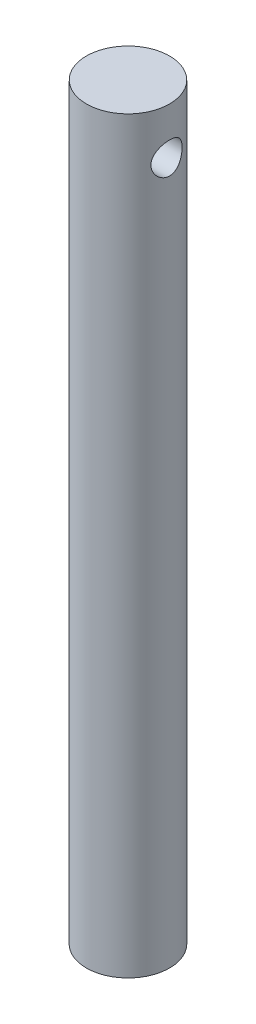
ISO-10303-21;
HEADER;
FILE_DESCRIPTION(('STEP AP214'),'2;1');
FILE_NAME('part.step','',(''),(''),'','','');
FILE_SCHEMA(('AUTOMOTIVE_DESIGN { 1 0 10303 214 1 1 1 1 }'));
ENDSEC;
DATA;
#1=APPLICATION_CONTEXT('core data for automotive mechanical design processes');
#2=APPLICATION_PROTOCOL_DEFINITION('international standard','automotive_design',2000,#1);
#3=PRODUCT_CONTEXT('',#1,'mechanical');
#4=PRODUCT('Part','Part','',(#3));
#5=PRODUCT_RELATED_PRODUCT_CATEGORY('part','',(#4));
#6=PRODUCT_DEFINITION_FORMATION('','',#4);
#7=PRODUCT_DEFINITION_CONTEXT('part definition',#1,'design');
#8=PRODUCT_DEFINITION('design','',#6,#7);
#9=PRODUCT_DEFINITION_SHAPE('','',#8);
#10=(LENGTH_UNIT() NAMED_UNIT(*) SI_UNIT(.MILLI.,.METRE.));
#11=(NAMED_UNIT(*) PLANE_ANGLE_UNIT() SI_UNIT($,.RADIAN.));
#12=(NAMED_UNIT(*) SI_UNIT($,.STERADIAN.) SOLID_ANGLE_UNIT());
#13=UNCERTAINTY_MEASURE_WITH_UNIT(LENGTH_MEASURE(1.E-05),#10,'distance_accuracy_value','');
#14=(GEOMETRIC_REPRESENTATION_CONTEXT(3) GLOBAL_UNCERTAINTY_ASSIGNED_CONTEXT((#13)) GLOBAL_UNIT_ASSIGNED_CONTEXT((#10,
#11,#12)) REPRESENTATION_CONTEXT('',''));
#15=CARTESIAN_POINT('',(0.,0.,0.));
#16=DIRECTION('',(0.,0.,1.));
#17=DIRECTION('',(1.,0.,0.));
#18=AXIS2_PLACEMENT_3D('',#15,#16,#17);
#19=CARTESIAN_POINT('',(0.,36.,0.));
#20=DIRECTION('',(0.,-1.,0.));
#21=DIRECTION('',(0.,0.,-1.));
#22=AXIS2_PLACEMENT_3D('',#19,#20,#21);
#23=CYLINDRICAL_SURFACE('',#22,2.);
#24=CARTESIAN_POINT('',(-1.85404962177392,33.75,-0.75));
#25=CARTESIAN_POINT('',(-1.85404820316903,33.7905037418604,-0.750001520530546));
#26=CARTESIAN_POINT('',(-1.85539130120493,33.8309974612518,-0.746707987747436));
#27=CARTESIAN_POINT('',(-1.86058079652483,33.9107640414566,-0.73368093947734));
#28=CARTESIAN_POINT('',(-1.86442711883556,33.9500369387975,-0.723947616866317));
#29=CARTESIAN_POINT('',(-1.8741274014045,34.0261876858068,-0.69844828805287));
#30=CARTESIAN_POINT('',(-1.8799765478463,34.0630710283255,-0.682696736331744));
#31=CARTESIAN_POINT('',(-1.89301567103299,34.1336859484094,-0.645659283713491));
#32=CARTESIAN_POINT('',(-1.90020605033661,34.1674165751413,-0.624371720475196));
#33=CARTESIAN_POINT('',(-1.91551787332856,34.2324451558114,-0.575733306870814));
#34=CARTESIAN_POINT('',(-1.92366670961802,34.2635642648147,-0.548151906066536));
#35=CARTESIAN_POINT('',(-1.93974875314273,34.3208614073357,-0.488197919889468));
#36=CARTESIAN_POINT('',(-1.94768191407392,34.3470383868709,-0.455824315128343));
#37=CARTESIAN_POINT('',(-1.96276436968277,34.3945697561478,-0.385847327588801));
#38=CARTESIAN_POINT('',(-1.96987780611753,34.4157297373579,-0.348103473769014));
#39=CARTESIAN_POINT('',(-1.98219003986924,34.4513255862625,-0.269277885982622));
#40=CARTESIAN_POINT('',(-1.98738950108503,34.465763785996,-0.228197315466766));
#41=CARTESIAN_POINT('',(-1.9950934855172,34.4868789478873,-0.145744670838414));
#42=CARTESIAN_POINT('',(-1.99770457607387,34.4938638137202,-0.104461598640797));
#43=CARTESIAN_POINT('',(-2.0003200705397,34.5008606004725,-0.021232181897393));
#44=CARTESIAN_POINT('',(-2.00032532207451,34.5008747888093,0.0207139425314158));
#45=CARTESIAN_POINT('',(-1.99779632951947,34.4941091192674,0.101871771532237));
#46=CARTESIAN_POINT('',(-1.99538770998342,34.4876653510256,0.141116089133449));
#47=CARTESIAN_POINT('',(-1.98846637466131,34.4687320423872,0.217919608992195));
#48=CARTESIAN_POINT('',(-1.98395350987789,34.456242073869,0.255478691715149));
#49=CARTESIAN_POINT('',(-1.97318884583765,34.4254147741621,0.328494508651552));
#50=CARTESIAN_POINT('',(-1.96691269735038,34.4069949973658,0.363912696143655));
#51=CARTESIAN_POINT('',(-1.9532565511264,34.3649039515353,0.43124330397878));
#52=CARTESIAN_POINT('',(-1.9458761975642,34.3412309884912,0.463154588466161));
#53=CARTESIAN_POINT('',(-1.93026264827908,34.2876863568584,0.524545243400468));
#54=CARTESIAN_POINT('',(-1.92200481881941,34.2575330421748,0.553773072631742));
#55=CARTESIAN_POINT('',(-1.90591230322861,34.1927035033392,0.606851977846713));
#56=CARTESIAN_POINT('',(-1.89807772374424,34.1580261467067,0.630701703464499));
#57=CARTESIAN_POINT('',(-1.88356351750168,34.0841402662686,0.672828059040756));
#58=CARTESIAN_POINT('',(-1.87691338575138,34.044848253157,0.690969239259152));
#59=CARTESIAN_POINT('',(-1.86586219314501,33.9634518874162,0.720282322207504));
#60=CARTESIAN_POINT('',(-1.86145988102892,33.9213491142032,0.731458103027974));
#61=CARTESIAN_POINT('',(-1.85569798611424,33.838012018842,0.745950958548341));
#62=CARTESIAN_POINT('',(-1.85418392620768,33.7968579472319,0.74966760579483));
#63=CARTESIAN_POINT('',(-1.85393269762508,33.7144953216291,0.750289428181361));
#64=CARTESIAN_POINT('',(-1.85519483501993,33.6732867838238,0.747196305468809));
#65=CARTESIAN_POINT('',(-1.86019690814868,33.5940350388562,0.734648667600784));
#66=CARTESIAN_POINT('',(-1.86381638108224,33.5559344321177,0.725503091671123));
#67=CARTESIAN_POINT('',(-1.87298243523181,33.4818260276399,0.701498873203189));
#68=CARTESIAN_POINT('',(-1.87852941125086,33.4458186604159,0.686639060173116));
#69=CARTESIAN_POINT('',(-1.8911812155804,33.3754177809619,0.651001461376389));
#70=CARTESIAN_POINT('',(-1.89833664446033,33.3411353539313,0.630022725885232));
#71=CARTESIAN_POINT('',(-1.91331407147146,33.276435509137,0.582956589312394));
#72=CARTESIAN_POINT('',(-1.92113631297038,33.2460195126877,0.556867318482174));
#73=CARTESIAN_POINT('',(-1.93716523276592,33.1879158134024,0.498363670450471));
#74=CARTESIAN_POINT('',(-1.94536484678514,33.1605232956156,0.465653170745531));
#75=CARTESIAN_POINT('',(-1.96074937481651,33.1115808162053,0.395898735876575));
#76=CARTESIAN_POINT('',(-1.96793428553832,33.0900308735271,0.358854786661336));
#77=CARTESIAN_POINT('',(-1.98047492852276,33.0535269719002,0.281508164734239));
#78=CARTESIAN_POINT('',(-1.98583690669005,33.0385504381037,0.241217216532314));
#79=CARTESIAN_POINT('',(-1.99414718356286,33.015671793075,0.158440943761628));
#80=CARTESIAN_POINT('',(-1.99709661649706,33.0077663572888,0.115956660361796));
#81=CARTESIAN_POINT('',(-2.00014203658537,32.9996127986226,0.0326677926369077));
#82=CARTESIAN_POINT('',(-2.00039430476882,32.9989452584705,-0.00809038403042248));
#83=CARTESIAN_POINT('',(-1.99842444904612,33.0042075797227,-0.0891133932062116));
#84=CARTESIAN_POINT('',(-1.99620262356565,33.0101366454429,-0.129378284622628));
#85=CARTESIAN_POINT('',(-1.98960544801886,33.0281294257468,-0.207274124188562));
#86=CARTESIAN_POINT('',(-1.98528395689009,33.0400399529392,-0.244945365534415));
#87=CARTESIAN_POINT('',(-1.97493891810495,33.0695050066922,-0.317757736503193));
#88=CARTESIAN_POINT('',(-1.96891504827832,33.0870606016524,-0.35289838563777));
#89=CARTESIAN_POINT('',(-1.95545309150037,33.1281569717524,-0.421270088497205));
#90=CARTESIAN_POINT('',(-1.94796620054414,33.1519183202571,-0.454358774423422));
#91=CARTESIAN_POINT('',(-1.93249753847422,33.2044039150938,-0.516208673761679));
#92=CARTESIAN_POINT('',(-1.92451559137014,33.2331299329039,-0.544968335627949));
#93=CARTESIAN_POINT('',(-1.90844064869588,33.2965320658225,-0.598906071180978));
#94=CARTESIAN_POINT('',(-1.9003640267458,33.3314422010772,-0.623814999080125));
#95=CARTESIAN_POINT('',(-1.88549162501819,33.4052079347867,-0.667423547784216));
#96=CARTESIAN_POINT('',(-1.87869597815608,33.4440639420267,-0.686122524390783));
#97=CARTESIAN_POINT('',(-1.86701134926633,33.5264778404877,-0.717329434871299));
#98=CARTESIAN_POINT('',(-1.8622190164543,33.5701671832559,-0.729530014497611));
#99=CARTESIAN_POINT('',(-1.85573997168158,33.6592426359779,-0.745861783610395));
#100=CARTESIAN_POINT('',(-1.85405121089868,33.704627606355,-0.749998296697853));
#101=CARTESIAN_POINT('',(-1.85404962177392,33.75,-0.75));
#102=B_SPLINE_CURVE_WITH_KNOTS('',3,(#24,#25,#26,#27,#28,#29,#30,#31,#32,#33,#34,#35,#36,#37,
#38,#39,#40,#41,#42,#43,#44,#45,#46,#47,#48,#49,#50,#51,#52,#53,#54,#55,#56,#57,#58,#59,#60,#61,
#62,#63,#64,#65,#66,#67,#68,#69,#70,#71,#72,#73,#74,#75,#76,#77,#78,#79,#80,#81,#82,#83,#84,#85,
#86,#87,#88,#89,#90,#91,#92,#93,#94,#95,#96,#97,#98,#99,#100,#101),.UNSPECIFIED.,.T.,.F.,(4,2,2,
2,2,2,2,2,2,2,2,2,2,2,2,2,2,2,2,2,2,2,2,2,2,2,2,2,2,2,2,2,2,2,2,2,2,2,4),(0.,0.121342270708086,
0.242680907299427,0.363729928378505,0.484815339841463,0.611373262005635,0.737958144114912,
0.868850360682108,0.999697131906655,1.1249000924484,1.25006232702429,1.36903236401597,
1.48801082631668,1.60872065605334,1.72946946814488,1.85728337532937,1.98512933913667,
2.11581296126482,2.24642375817737,2.36982828870243,2.49320197694442,2.610719229641,
2.72826056714763,2.85020780502911,2.97219974233178,3.10192508496812,3.23165084825089,
3.36092754445084,3.49014342780064,3.61182860274968,3.7334991015974,3.85220137001945,
3.97092611756416,4.09464161838494,4.21840135447483,4.3486929977104,4.47899815272121,
4.61501589435462,4.75094381161527),.UNSPECIFIED.);
#103=CARTESIAN_POINT('',(-1.85404962177392,33.75,-0.75));
#104=VERTEX_POINT('',#103);
#105=EDGE_CURVE('E41',#104,#104,#102,.T.);
#106=ORIENTED_EDGE('',*,*,#105,.T.);
#107=EDGE_LOOP('',(#106));
#108=FACE_BOUND('',#107,.T.);
#109=CARTESIAN_POINT('',(1.85404962177392,33.75,-0.75));
#110=CARTESIAN_POINT('',(1.85404820316903,33.7094962581396,-0.750001520530546));
#111=CARTESIAN_POINT('',(1.85539130120493,33.6690025387482,-0.746707987747436));
#112=CARTESIAN_POINT('',(1.86058079652483,33.5892359585434,-0.733680939477339));
#113=CARTESIAN_POINT('',(1.86442711883556,33.5499630612025,-0.723947616866317));
#114=CARTESIAN_POINT('',(1.8741274014045,33.4738123141932,-0.69844828805287));
#115=CARTESIAN_POINT('',(1.8799765478463,33.4369289716745,-0.682696736331742));
#116=CARTESIAN_POINT('',(1.89301567103299,33.3663140515906,-0.645659283713489));
#117=CARTESIAN_POINT('',(1.90020605033661,33.3325834248587,-0.624371720475195));
#118=CARTESIAN_POINT('',(1.91551787332856,33.2675548441886,-0.575733306870813));
#119=CARTESIAN_POINT('',(1.92366670961802,33.2364357351853,-0.548151906066536));
#120=CARTESIAN_POINT('',(1.93974875314273,33.1791385926642,-0.488197919889468));
#121=CARTESIAN_POINT('',(1.94768191407392,33.1529616131291,-0.455824315128343));
#122=CARTESIAN_POINT('',(1.96276436968277,33.1054302438522,-0.385847327588801));
#123=CARTESIAN_POINT('',(1.96987780611753,33.0842702626421,-0.348103473769014));
#124=CARTESIAN_POINT('',(1.98219003986924,33.0486744137375,-0.269277885982622));
#125=CARTESIAN_POINT('',(1.98738950108503,33.034236214004,-0.228197315466766));
#126=CARTESIAN_POINT('',(1.9950934855172,33.0131210521127,-0.145744670838414));
#127=CARTESIAN_POINT('',(1.99770457607387,33.0061361862798,-0.104461598640797));
#128=CARTESIAN_POINT('',(2.0003200705397,32.9991393995275,-0.021232181897393));
#129=CARTESIAN_POINT('',(2.00032532207451,32.9991252111906,0.0207139425314158));
#130=CARTESIAN_POINT('',(1.99779632951947,33.0058908807326,0.101871771532237));
#131=CARTESIAN_POINT('',(1.99538770998342,33.0123346489744,0.141116089133449));
#132=CARTESIAN_POINT('',(1.98846637466131,33.0312679576128,0.217919608992195));
#133=CARTESIAN_POINT('',(1.98395350987789,33.043757926131,0.255478691715149));
#134=CARTESIAN_POINT('',(1.97318884583765,33.0745852258379,0.328494508651552));
#135=CARTESIAN_POINT('',(1.96691269735038,33.0930050026342,0.363912696143655));
#136=CARTESIAN_POINT('',(1.9532565511264,33.1350960484647,0.43124330397878));
#137=CARTESIAN_POINT('',(1.9458761975642,33.1587690115088,0.463154588466161));
#138=CARTESIAN_POINT('',(1.93026264827908,33.2123136431416,0.524545243400468));
#139=CARTESIAN_POINT('',(1.92200481881941,33.2424669578252,0.553773072631742));
#140=CARTESIAN_POINT('',(1.90591230322861,33.3072964966608,0.606851977846713));
#141=CARTESIAN_POINT('',(1.89807772374424,33.3419738532933,0.630701703464499));
#142=CARTESIAN_POINT('',(1.88356351750168,33.4158597337314,0.672828059040756));
#143=CARTESIAN_POINT('',(1.87691338575138,33.455151746843,0.690969239259152));
#144=CARTESIAN_POINT('',(1.86586219314501,33.5365481125838,0.720282322207504));
#145=CARTESIAN_POINT('',(1.86145988102892,33.5786508857968,0.731458103027974));
#146=CARTESIAN_POINT('',(1.85569798611424,33.661987981158,0.745950958548341));
#147=CARTESIAN_POINT('',(1.85418392620768,33.7031420527681,0.74966760579483));
#148=CARTESIAN_POINT('',(1.85393269762508,33.7855046783709,0.750289428181361));
#149=CARTESIAN_POINT('',(1.85519483501993,33.8267132161762,0.747196305468809));
#150=CARTESIAN_POINT('',(1.86019690814868,33.9059649611438,0.734648667600784));
#151=CARTESIAN_POINT('',(1.86381638108224,33.9440655678823,0.725503091671123));
#152=CARTESIAN_POINT('',(1.87298243523181,34.0181739723601,0.701498873203189));
#153=CARTESIAN_POINT('',(1.87852941125086,34.0541813395841,0.686639060173116));
#154=CARTESIAN_POINT('',(1.8911812155804,34.1245822190381,0.651001461376389));
#155=CARTESIAN_POINT('',(1.89833664446033,34.1588646460687,0.630022725885232));
#156=CARTESIAN_POINT('',(1.91331407147146,34.223564490863,0.582956589312394));
#157=CARTESIAN_POINT('',(1.92113631297038,34.2539804873123,0.556867318482174));
#158=CARTESIAN_POINT('',(1.93716523276592,34.3120841865975,0.498363670450472));
#159=CARTESIAN_POINT('',(1.94536484678514,34.3394767043844,0.465653170745534));
#160=CARTESIAN_POINT('',(1.96074937481651,34.3884191837947,0.395898735876577));
#161=CARTESIAN_POINT('',(1.96793428553832,34.4099691264729,0.358854786661337));
#162=CARTESIAN_POINT('',(1.98047492852276,34.4464730280998,0.281508164734238));
#163=CARTESIAN_POINT('',(1.98583690669005,34.4614495618963,0.241217216532314));
#164=CARTESIAN_POINT('',(1.99414718356286,34.484328206925,0.158440943761628));
#165=CARTESIAN_POINT('',(1.99709661649706,34.4922336427112,0.115956660361796));
#166=CARTESIAN_POINT('',(2.00014203658537,34.5003872013774,0.0326677926369077));
#167=CARTESIAN_POINT('',(2.00039430476882,34.5010547415295,-0.00809038403042248));
#168=CARTESIAN_POINT('',(1.99842444904612,34.4957924202773,-0.0891133932062116));
#169=CARTESIAN_POINT('',(1.99620262356565,34.4898633545571,-0.129378284622628));
#170=CARTESIAN_POINT('',(1.98960544801886,34.4718705742532,-0.207274124188562));
#171=CARTESIAN_POINT('',(1.98528395689009,34.4599600470608,-0.244945365534415));
#172=CARTESIAN_POINT('',(1.97493891810495,34.4304949933078,-0.317757736503193));
#173=CARTESIAN_POINT('',(1.96891504827832,34.4129393983476,-0.35289838563777));
#174=CARTESIAN_POINT('',(1.95545309150037,34.3718430282476,-0.421270088497205));
#175=CARTESIAN_POINT('',(1.94796620054414,34.3480816797429,-0.454358774423422));
#176=CARTESIAN_POINT('',(1.93249753847422,34.2955960849062,-0.516208673761679));
#177=CARTESIAN_POINT('',(1.92451559137014,34.2668700670961,-0.544968335627949));
#178=CARTESIAN_POINT('',(1.90844064869588,34.2034679341775,-0.598906071180978));
#179=CARTESIAN_POINT('',(1.9003640267458,34.1685577989228,-0.623814999080125));
#180=CARTESIAN_POINT('',(1.88549162501819,34.0947920652133,-0.667423547784216));
#181=CARTESIAN_POINT('',(1.87869597815608,34.0559360579733,-0.686122524390783));
#182=CARTESIAN_POINT('',(1.86701134926633,33.9735221595123,-0.717329434871302));
#183=CARTESIAN_POINT('',(1.8622190164543,33.9298328167441,-0.729530014497615));
#184=CARTESIAN_POINT('',(1.85573997168158,33.8407573640221,-0.745861783610397));
#185=CARTESIAN_POINT('',(1.85405121089868,33.795372393645,-0.749998296697853));
#186=CARTESIAN_POINT('',(1.85404962177392,33.75,-0.75));
#187=B_SPLINE_CURVE_WITH_KNOTS('',3,(#109,#110,#111,#112,#113,#114,#115,#116,#117,#118,#119,
#120,#121,#122,#123,#124,#125,#126,#127,#128,#129,#130,#131,#132,#133,#134,#135,#136,#137,#138,
#139,#140,#141,#142,#143,#144,#145,#146,#147,#148,#149,#150,#151,#152,#153,#154,#155,#156,#157,
#158,#159,#160,#161,#162,#163,#164,#165,#166,#167,#168,#169,#170,#171,#172,#173,#174,#175,#176,
#177,#178,#179,#180,#181,#182,#183,#184,#185,#186),.UNSPECIFIED.,.T.,.F.,(4,2,2,2,2,2,2,2,2,2,2,
2,2,2,2,2,2,2,2,2,2,2,2,2,2,2,2,2,2,2,2,2,2,2,2,2,2,2,4),(0.,0.121342270708086,
0.242680907299427,0.363729928378513,0.484815339841463,0.611373262005635,0.737958144114913,
0.868850360682109,0.999697131906655,1.1249000924484,1.25006232702429,1.36903236401597,
1.48801082631668,1.60872065605334,1.72946946814488,1.85728337532937,1.98512933913667,
2.11581296126482,2.24642375817737,2.36982828870243,2.49320197694442,2.610719229641,
2.72826056714763,2.85020780502911,2.97219974233178,3.10192508496812,3.23165084825089,
3.36092754445084,3.49014342780064,3.61182860274968,3.7334991015974,3.85220137001945,
3.97092611756416,4.09464161838494,4.21840135447483,4.3486929977104,4.47899815272121,
4.61501589435464,4.75094381161527),.UNSPECIFIED.);
#188=CARTESIAN_POINT('',(1.85404962177392,33.75,-0.75));
#189=VERTEX_POINT('',#188);
#190=EDGE_CURVE('E57',#189,#189,#187,.T.);
#191=ORIENTED_EDGE('',*,*,#190,.T.);
#192=EDGE_LOOP('',(#191));
#193=FACE_BOUND('',#192,.T.);
#194=CARTESIAN_POINT('',(0.,36.,0.));
#195=DIRECTION('',(0.,1.,0.));
#196=DIRECTION('',(0.,0.,1.));
#197=AXIS2_PLACEMENT_3D('',#194,#195,#196);
#198=CIRCLE('',#197,2.);
#199=CARTESIAN_POINT('',(0.,36.,2.));
#200=VERTEX_POINT('',#199);
#201=EDGE_CURVE('E10',#200,#200,#198,.T.);
#202=ORIENTED_EDGE('',*,*,#201,.F.);
#203=EDGE_LOOP('',(#202));
#204=FACE_BOUND('',#203,.T.);
#205=CARTESIAN_POINT('',(0.,0.,0.));
#206=DIRECTION('',(0.,1.,0.));
#207=DIRECTION('',(0.,0.,1.));
#208=AXIS2_PLACEMENT_3D('',#205,#206,#207);
#209=CIRCLE('',#208,2.);
#210=CARTESIAN_POINT('',(0.,0.,2.));
#211=VERTEX_POINT('',#210);
#212=EDGE_CURVE('E50',#211,#211,#209,.T.);
#213=ORIENTED_EDGE('',*,*,#212,.T.);
#214=EDGE_LOOP('',(#213));
#215=FACE_BOUND('',#214,.T.);
#216=ADVANCED_FACE('F37',(#108,#193,#204,#215),#23,.T.);
#217=CARTESIAN_POINT('',(0.,36.,0.));
#218=DIRECTION('',(0.,1.,0.));
#219=DIRECTION('',(0.,0.,1.));
#220=AXIS2_PLACEMENT_3D('',#217,#218,#219);
#221=PLANE('',#220);
#222=ORIENTED_EDGE('',*,*,#201,.T.);
#223=EDGE_LOOP('',(#222));
#224=FACE_BOUND('',#223,.T.);
#225=ADVANCED_FACE('F69',(#224),#221,.T.);
#226=CARTESIAN_POINT('',(0.,0.,0.));
#227=DIRECTION('',(0.,1.,0.));
#228=DIRECTION('',(0.,0.,1.));
#229=AXIS2_PLACEMENT_3D('',#226,#227,#228);
#230=PLANE('',#229);
#231=ORIENTED_EDGE('',*,*,#212,.F.);
#232=EDGE_LOOP('',(#231));
#233=FACE_BOUND('',#232,.T.);
#234=ADVANCED_FACE('F67',(#233),#230,.F.);
#235=CARTESIAN_POINT('',(-18.,33.75,0.));
#236=DIRECTION('',(1.,0.,0.));
#237=DIRECTION('',(0.,0.,-1.));
#238=AXIS2_PLACEMENT_3D('',#235,#236,#237);
#239=CYLINDRICAL_SURFACE('',#238,0.75);
#240=ORIENTED_EDGE('',*,*,#190,.F.);
#241=EDGE_LOOP('',(#240));
#242=FACE_BOUND('',#241,.T.);
#243=ORIENTED_EDGE('',*,*,#105,.F.);
#244=EDGE_LOOP('',(#243));
#245=FACE_BOUND('',#244,.T.);
#246=ADVANCED_FACE('F63',(#242,#245),#239,.F.);
#247=CLOSED_SHELL('',(#216,#225,#234,#246));
#248=MANIFOLD_SOLID_BREP('B2',#247);
#249=ADVANCED_BREP_SHAPE_REPRESENTATION('',(#18,#248),#14);
#250=SHAPE_DEFINITION_REPRESENTATION(#9,#249);
ENDSEC;
END-ISO-10303-21;
